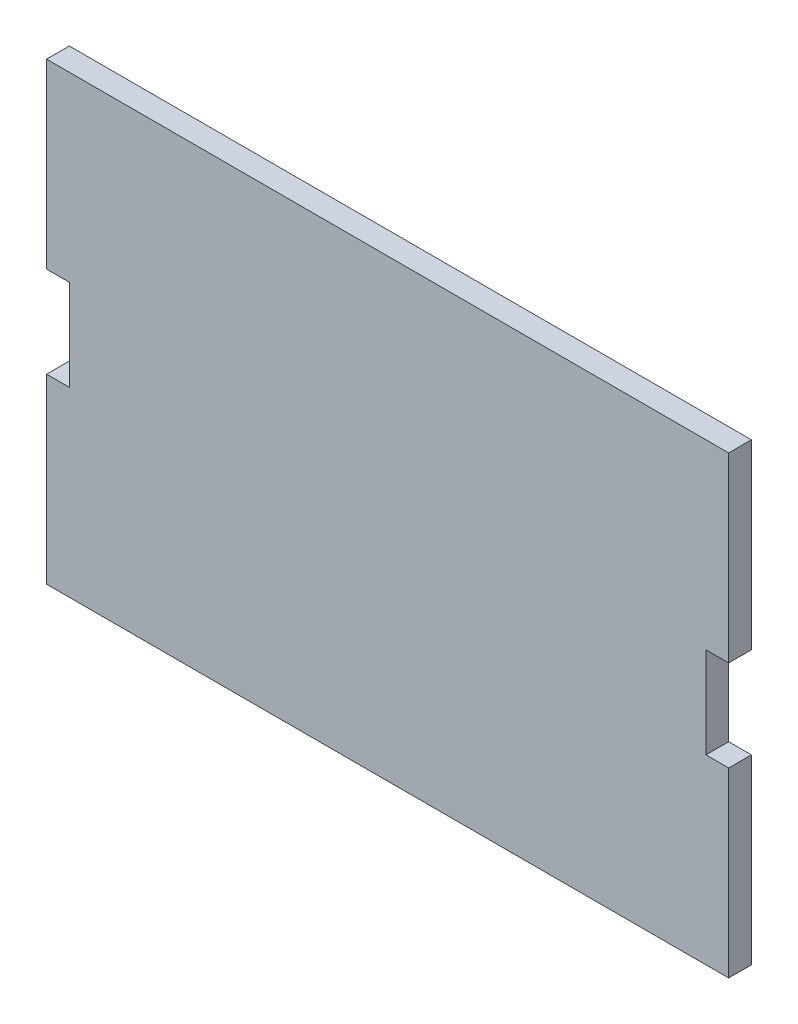
ISO-10303-21;
HEADER;
FILE_DESCRIPTION(('STEP AP214'),'2;1');
FILE_NAME('part.step','',(''),(''),'','','');
FILE_SCHEMA(('AUTOMOTIVE_DESIGN { 1 0 10303 214 1 1 1 1 }'));
ENDSEC;
DATA;
#1=APPLICATION_CONTEXT('core data for automotive mechanical design processes');
#2=APPLICATION_PROTOCOL_DEFINITION('international standard','automotive_design',2000,#1);
#3=PRODUCT_CONTEXT('',#1,'mechanical');
#4=PRODUCT('Part','Part','',(#3));
#5=PRODUCT_RELATED_PRODUCT_CATEGORY('part','',(#4));
#6=PRODUCT_DEFINITION_FORMATION('','',#4);
#7=PRODUCT_DEFINITION_CONTEXT('part definition',#1,'design');
#8=PRODUCT_DEFINITION('design','',#6,#7);
#9=PRODUCT_DEFINITION_SHAPE('','',#8);
#10=(LENGTH_UNIT() NAMED_UNIT(*) SI_UNIT(.MILLI.,.METRE.));
#11=(NAMED_UNIT(*) PLANE_ANGLE_UNIT() SI_UNIT($,.RADIAN.));
#12=(NAMED_UNIT(*) SI_UNIT($,.STERADIAN.) SOLID_ANGLE_UNIT());
#13=UNCERTAINTY_MEASURE_WITH_UNIT(LENGTH_MEASURE(1.E-05),#10,'distance_accuracy_value','');
#14=(GEOMETRIC_REPRESENTATION_CONTEXT(3) GLOBAL_UNCERTAINTY_ASSIGNED_CONTEXT((#13)) GLOBAL_UNIT_ASSIGNED_CONTEXT((#10,
#11,#12)) REPRESENTATION_CONTEXT('',''));
#15=CARTESIAN_POINT('',(0.,0.,0.));
#16=DIRECTION('',(0.,0.,1.));
#17=DIRECTION('',(1.,0.,0.));
#18=AXIS2_PLACEMENT_3D('',#15,#16,#17);
#19=CARTESIAN_POINT('',(750.,2.77555756156289E-13,50.));
#20=DIRECTION('',(-1.,0.,0.));
#21=DIRECTION('',(0.,-1.,0.));
#22=AXIS2_PLACEMENT_3D('',#19,#20,#21);
#23=PLANE('',#22);
#24=DIRECTION('',(0.,1.,0.));
#25=VECTOR('',#24,1.);
#26=CARTESIAN_POINT('',(750.,2.77555756156289E-13,0.));
#27=LINE('',#26,#25);
#28=CARTESIAN_POINT('',(750.,-1000.,0.));
#29=VERTEX_POINT('',#28);
#30=CARTESIAN_POINT('',(750.000000000001,-600.,0.));
#31=VERTEX_POINT('',#30);
#32=EDGE_CURVE('E148',#29,#31,#27,.T.);
#33=ORIENTED_EDGE('',*,*,#32,.T.);
#34=DIRECTION('',(0.,0.,1.));
#35=VECTOR('',#34,1.);
#36=CARTESIAN_POINT('',(750.000000000001,-600.,-0.001000000000001));
#37=LINE('',#36,#35);
#38=CARTESIAN_POINT('',(750.000000000001,-600.,50.));
#39=VERTEX_POINT('',#38);
#40=EDGE_CURVE('E133',#31,#39,#37,.T.);
#41=ORIENTED_EDGE('',*,*,#40,.T.);
#42=DIRECTION('',(0.,1.,0.));
#43=VECTOR('',#42,1.);
#44=CARTESIAN_POINT('',(750.,2.77555756156289E-13,50.));
#45=LINE('',#44,#43);
#46=CARTESIAN_POINT('',(750.,-1000.,50.));
#47=VERTEX_POINT('',#46);
#48=EDGE_CURVE('E170',#47,#39,#45,.T.);
#49=ORIENTED_EDGE('',*,*,#48,.F.);
#50=DIRECTION('',(0.,0.,-1.));
#51=VECTOR('',#50,1.);
#52=CARTESIAN_POINT('',(750.,-1000.,50.));
#53=LINE('',#52,#51);
#54=EDGE_CURVE('E44',#47,#29,#53,.T.);
#55=ORIENTED_EDGE('',*,*,#54,.T.);
#56=EDGE_LOOP('',(#33,#41,#49,#55));
#57=FACE_BOUND('',#56,.T.);
#58=ADVANCED_FACE('F36',(#57),#23,.F.);
#59=CARTESIAN_POINT('',(-750.,0.,50.));
#60=DIRECTION('',(1.,0.,0.));
#61=DIRECTION('',(0.,0.,-1.));
#62=AXIS2_PLACEMENT_3D('',#59,#60,#61);
#63=PLANE('',#62);
#64=DIRECTION('',(0.,-1.,0.));
#65=VECTOR('',#64,1.);
#66=CARTESIAN_POINT('',(-750.,0.,0.));
#67=LINE('',#66,#65);
#68=CARTESIAN_POINT('',(-750.,0.,0.));
#69=VERTEX_POINT('',#68);
#70=CARTESIAN_POINT('',(-750.,-400.,0.));
#71=VERTEX_POINT('',#70);
#72=EDGE_CURVE('E152',#69,#71,#67,.T.);
#73=ORIENTED_EDGE('',*,*,#72,.T.);
#74=DIRECTION('',(0.,0.,1.));
#75=VECTOR('',#74,1.);
#76=CARTESIAN_POINT('',(-750.,-400.,-0.001000000000001));
#77=LINE('',#76,#75);
#78=CARTESIAN_POINT('',(-750.,-400.,50.));
#79=VERTEX_POINT('',#78);
#80=EDGE_CURVE('E205',#71,#79,#77,.T.);
#81=ORIENTED_EDGE('',*,*,#80,.T.);
#82=DIRECTION('',(0.,-1.,0.));
#83=VECTOR('',#82,1.);
#84=CARTESIAN_POINT('',(-750.,0.,50.));
#85=LINE('',#84,#83);
#86=CARTESIAN_POINT('',(-750.,0.,50.));
#87=VERTEX_POINT('',#86);
#88=EDGE_CURVE('E216',#87,#79,#85,.T.);
#89=ORIENTED_EDGE('',*,*,#88,.F.);
#90=DIRECTION('',(0.,0.,-1.));
#91=VECTOR('',#90,1.);
#92=CARTESIAN_POINT('',(-750.,0.,50.));
#93=LINE('',#92,#91);
#94=EDGE_CURVE('E158',#87,#69,#93,.T.);
#95=ORIENTED_EDGE('',*,*,#94,.T.);
#96=EDGE_LOOP('',(#73,#81,#89,#95));
#97=FACE_BOUND('',#96,.T.);
#98=ADVANCED_FACE('F242',(#97),#63,.F.);
#99=CARTESIAN_POINT('',(-750.,-600.,50.));
#100=VERTEX_POINT('',#99);
#101=CARTESIAN_POINT('',(-750.,-1000.,50.));
#102=VERTEX_POINT('',#101);
#103=EDGE_CURVE('E157',#100,#102,#85,.T.);
#104=ORIENTED_EDGE('',*,*,#103,.F.);
#105=DIRECTION('',(0.,0.,1.));
#106=VECTOR('',#105,1.);
#107=CARTESIAN_POINT('',(-750.,-600.,-0.001000000000001));
#108=LINE('',#107,#106);
#109=CARTESIAN_POINT('',(-750.,-600.,0.));
#110=VERTEX_POINT('',#109);
#111=EDGE_CURVE('E204',#110,#100,#108,.T.);
#112=ORIENTED_EDGE('',*,*,#111,.F.);
#113=CARTESIAN_POINT('',(-750.,-1000.,0.));
#114=VERTEX_POINT('',#113);
#115=EDGE_CURVE('E215',#110,#114,#67,.T.);
#116=ORIENTED_EDGE('',*,*,#115,.T.);
#117=DIRECTION('',(0.,0.,-1.));
#118=VECTOR('',#117,1.);
#119=CARTESIAN_POINT('',(-750.,-1000.,50.));
#120=LINE('',#119,#118);
#121=EDGE_CURVE('E11',#102,#114,#120,.T.);
#122=ORIENTED_EDGE('',*,*,#121,.F.);
#123=EDGE_LOOP('',(#104,#112,#116,#122));
#124=FACE_BOUND('',#123,.T.);
#125=ADVANCED_FACE('F38',(#124),#63,.F.);
#126=CARTESIAN_POINT('',(-750.,-1000.,50.));
#127=DIRECTION('',(0.,1.,0.));
#128=DIRECTION('',(-1.,0.,0.));
#129=AXIS2_PLACEMENT_3D('',#126,#127,#128);
#130=PLANE('',#129);
#131=DIRECTION('',(1.,0.,0.));
#132=VECTOR('',#131,1.);
#133=CARTESIAN_POINT('',(-750.,-1000.,0.));
#134=LINE('',#133,#132);
#135=EDGE_CURVE('E149',#114,#29,#134,.T.);
#136=ORIENTED_EDGE('',*,*,#135,.T.);
#137=ORIENTED_EDGE('',*,*,#54,.F.);
#138=DIRECTION('',(1.,0.,0.));
#139=VECTOR('',#138,1.);
#140=CARTESIAN_POINT('',(-750.,-1000.,50.));
#141=LINE('',#140,#139);
#142=EDGE_CURVE('E219',#102,#47,#141,.T.);
#143=ORIENTED_EDGE('',*,*,#142,.F.);
#144=ORIENTED_EDGE('',*,*,#121,.T.);
#145=EDGE_LOOP('',(#136,#137,#143,#144));
#146=FACE_BOUND('',#145,.T.);
#147=ADVANCED_FACE('F250',(#146),#130,.F.);
#148=CARTESIAN_POINT('',(750.000000000001,-400.,50.));
#149=VERTEX_POINT('',#148);
#150=CARTESIAN_POINT('',(750.,2.77555756156289E-13,50.));
#151=VERTEX_POINT('',#150);
#152=EDGE_CURVE('E141',#149,#151,#45,.T.);
#153=ORIENTED_EDGE('',*,*,#152,.F.);
#154=DIRECTION('',(0.,0.,1.));
#155=VECTOR('',#154,1.);
#156=CARTESIAN_POINT('',(750.000000000001,-400.,-0.001000000000001));
#157=LINE('',#156,#155);
#158=CARTESIAN_POINT('',(750.,-400.,0.));
#159=VERTEX_POINT('',#158);
#160=EDGE_CURVE('E128',#159,#149,#157,.T.);
#161=ORIENTED_EDGE('',*,*,#160,.F.);
#162=CARTESIAN_POINT('',(750.,2.77555756156289E-13,0.));
#163=VERTEX_POINT('',#162);
#164=EDGE_CURVE('E139',#159,#163,#27,.T.);
#165=ORIENTED_EDGE('',*,*,#164,.T.);
#166=DIRECTION('',(0.,0.,-1.));
#167=VECTOR('',#166,1.);
#168=CARTESIAN_POINT('',(750.,2.77555756156289E-13,50.));
#169=LINE('',#168,#167);
#170=EDGE_CURVE('E161',#151,#163,#169,.T.);
#171=ORIENTED_EDGE('',*,*,#170,.F.);
#172=EDGE_LOOP('',(#153,#161,#165,#171));
#173=FACE_BOUND('',#172,.T.);
#174=ADVANCED_FACE('F137',(#173),#23,.F.);
#175=CARTESIAN_POINT('',(-750.,0.,50.));
#176=DIRECTION('',(0.,-1.,0.));
#177=DIRECTION('',(1.,0.,0.));
#178=AXIS2_PLACEMENT_3D('',#175,#176,#177);
#179=PLANE('',#178);
#180=DIRECTION('',(-1.,0.,0.));
#181=VECTOR('',#180,1.);
#182=CARTESIAN_POINT('',(-750.,0.,0.));
#183=LINE('',#182,#181);
#184=EDGE_CURVE('E147',#163,#69,#183,.T.);
#185=ORIENTED_EDGE('',*,*,#184,.T.);
#186=ORIENTED_EDGE('',*,*,#94,.F.);
#187=DIRECTION('',(-1.,0.,0.));
#188=VECTOR('',#187,1.);
#189=CARTESIAN_POINT('',(-750.,0.,50.));
#190=LINE('',#189,#188);
#191=EDGE_CURVE('E162',#151,#87,#190,.T.);
#192=ORIENTED_EDGE('',*,*,#191,.F.);
#193=ORIENTED_EDGE('',*,*,#170,.T.);
#194=EDGE_LOOP('',(#185,#186,#192,#193));
#195=FACE_BOUND('',#194,.T.);
#196=ADVANCED_FACE('F246',(#195),#179,.F.);
#197=CARTESIAN_POINT('',(0.,0.,50.));
#198=DIRECTION('',(0.,0.,1.));
#199=DIRECTION('',(1.,0.,0.));
#200=AXIS2_PLACEMENT_3D('',#197,#198,#199);
#201=PLANE('',#200);
#202=DIRECTION('',(1.,0.,0.));
#203=VECTOR('',#202,1.);
#204=CARTESIAN_POINT('',(750.000000000001,-600.,50.));
#205=LINE('',#204,#203);
#206=CARTESIAN_POINT('',(700.000000000001,-600.,50.));
#207=VERTEX_POINT('',#206);
#208=EDGE_CURVE('E142',#207,#39,#205,.T.);
#209=ORIENTED_EDGE('',*,*,#208,.F.);
#210=DIRECTION('',(0.,-1.,0.));
#211=VECTOR('',#210,1.);
#212=CARTESIAN_POINT('',(700.000000000001,-400.,50.));
#213=LINE('',#212,#211);
#214=CARTESIAN_POINT('',(700.000000000001,-400.,50.));
#215=VERTEX_POINT('',#214);
#216=EDGE_CURVE('E181',#215,#207,#213,.T.);
#217=ORIENTED_EDGE('',*,*,#216,.F.);
#218=DIRECTION('',(-1.,0.,0.));
#219=VECTOR('',#218,1.);
#220=CARTESIAN_POINT('',(750.000000000001,-400.,50.));
#221=LINE('',#220,#219);
#222=EDGE_CURVE('E179',#149,#215,#221,.T.);
#223=ORIENTED_EDGE('',*,*,#222,.F.);
#224=ORIENTED_EDGE('',*,*,#152,.T.);
#225=ORIENTED_EDGE('',*,*,#191,.T.);
#226=ORIENTED_EDGE('',*,*,#88,.T.);
#227=DIRECTION('',(-1.,0.,0.));
#228=VECTOR('',#227,1.);
#229=CARTESIAN_POINT('',(-750.,-400.,50.));
#230=LINE('',#229,#228);
#231=CARTESIAN_POINT('',(-700.,-400.,50.));
#232=VERTEX_POINT('',#231);
#233=EDGE_CURVE('E202',#232,#79,#230,.T.);
#234=ORIENTED_EDGE('',*,*,#233,.F.);
#235=DIRECTION('',(0.,1.,0.));
#236=VECTOR('',#235,1.);
#237=CARTESIAN_POINT('',(-700.,-400.,50.));
#238=LINE('',#237,#236);
#239=CARTESIAN_POINT('',(-700.,-600.,50.));
#240=VERTEX_POINT('',#239);
#241=EDGE_CURVE('E199',#240,#232,#238,.T.);
#242=ORIENTED_EDGE('',*,*,#241,.F.);
#243=DIRECTION('',(1.,0.,0.));
#244=VECTOR('',#243,1.);
#245=CARTESIAN_POINT('',(-750.,-600.,50.));
#246=LINE('',#245,#244);
#247=EDGE_CURVE('E196',#100,#240,#246,.T.);
#248=ORIENTED_EDGE('',*,*,#247,.F.);
#249=ORIENTED_EDGE('',*,*,#103,.T.);
#250=ORIENTED_EDGE('',*,*,#142,.T.);
#251=ORIENTED_EDGE('',*,*,#48,.T.);
#252=EDGE_LOOP('',(#209,#217,#223,#224,#225,#226,#234,#242,#248,#249,#250,#251));
#253=FACE_BOUND('',#252,.T.);
#254=ADVANCED_FACE('F238',(#253),#201,.T.);
#255=CARTESIAN_POINT('',(0.,0.,0.));
#256=DIRECTION('',(0.,0.,1.));
#257=DIRECTION('',(1.,0.,0.));
#258=AXIS2_PLACEMENT_3D('',#255,#256,#257);
#259=PLANE('',#258);
#260=DIRECTION('',(0.,1.,0.));
#261=VECTOR('',#260,1.);
#262=CARTESIAN_POINT('',(700.000000000001,-400.,0.));
#263=LINE('',#262,#261);
#264=CARTESIAN_POINT('',(700.000000000001,-600.,0.));
#265=VERTEX_POINT('',#264);
#266=CARTESIAN_POINT('',(700.000000000001,-400.,0.));
#267=VERTEX_POINT('',#266);
#268=EDGE_CURVE('E51',#265,#267,#263,.T.);
#269=ORIENTED_EDGE('',*,*,#268,.F.);
#270=DIRECTION('',(-1.,0.,0.));
#271=VECTOR('',#270,1.);
#272=CARTESIAN_POINT('',(750.000000000001,-600.,0.));
#273=LINE('',#272,#271);
#274=EDGE_CURVE('E177',#31,#265,#273,.T.);
#275=ORIENTED_EDGE('',*,*,#274,.F.);
#276=ORIENTED_EDGE('',*,*,#32,.F.);
#277=ORIENTED_EDGE('',*,*,#135,.F.);
#278=ORIENTED_EDGE('',*,*,#115,.F.);
#279=DIRECTION('',(-1.,0.,0.));
#280=VECTOR('',#279,1.);
#281=CARTESIAN_POINT('',(-750.,-600.,0.));
#282=LINE('',#281,#280);
#283=CARTESIAN_POINT('',(-700.,-600.,0.));
#284=VERTEX_POINT('',#283);
#285=EDGE_CURVE('E208',#284,#110,#282,.T.);
#286=ORIENTED_EDGE('',*,*,#285,.F.);
#287=DIRECTION('',(0.,-1.,0.));
#288=VECTOR('',#287,1.);
#289=CARTESIAN_POINT('',(-700.,-400.,0.));
#290=LINE('',#289,#288);
#291=CARTESIAN_POINT('',(-700.,-400.,0.));
#292=VERTEX_POINT('',#291);
#293=EDGE_CURVE('E59',#292,#284,#290,.T.);
#294=ORIENTED_EDGE('',*,*,#293,.F.);
#295=DIRECTION('',(1.,0.,0.));
#296=VECTOR('',#295,1.);
#297=CARTESIAN_POINT('',(-750.,-400.,0.));
#298=LINE('',#297,#296);
#299=EDGE_CURVE('E193',#71,#292,#298,.T.);
#300=ORIENTED_EDGE('',*,*,#299,.F.);
#301=ORIENTED_EDGE('',*,*,#72,.F.);
#302=ORIENTED_EDGE('',*,*,#184,.F.);
#303=ORIENTED_EDGE('',*,*,#164,.F.);
#304=DIRECTION('',(1.,0.,0.));
#305=VECTOR('',#304,1.);
#306=CARTESIAN_POINT('',(750.000000000001,-400.,0.));
#307=LINE('',#306,#305);
#308=EDGE_CURVE('E124',#267,#159,#307,.T.);
#309=ORIENTED_EDGE('',*,*,#308,.F.);
#310=EDGE_LOOP('',(#269,#275,#276,#277,#278,#286,#294,#300,#301,#302,#303,#309));
#311=FACE_BOUND('',#310,.T.);
#312=ADVANCED_FACE('F145',(#311),#259,.F.);
#313=CARTESIAN_POINT('',(-750.,-400.,-0.001000000000001));
#314=DIRECTION('',(0.,1.,0.));
#315=DIRECTION('',(0.,0.,1.));
#316=AXIS2_PLACEMENT_3D('',#313,#314,#315);
#317=PLANE('',#316);
#318=ORIENTED_EDGE('',*,*,#299,.T.);
#319=DIRECTION('',(0.,0.,1.));
#320=VECTOR('',#319,1.);
#321=CARTESIAN_POINT('',(-700.,-400.,-0.001000000000001));
#322=LINE('',#321,#320);
#323=EDGE_CURVE('E209',#292,#232,#322,.T.);
#324=ORIENTED_EDGE('',*,*,#323,.T.);
#325=ORIENTED_EDGE('',*,*,#233,.T.);
#326=ORIENTED_EDGE('',*,*,#80,.F.);
#327=EDGE_LOOP('',(#318,#324,#325,#326));
#328=FACE_BOUND('',#327,.T.);
#329=ADVANCED_FACE('F241',(#328),#317,.F.);
#330=CARTESIAN_POINT('',(-700.,-400.,-0.001000000000001));
#331=DIRECTION('',(1.,0.,0.));
#332=DIRECTION('',(0.,0.,-1.));
#333=AXIS2_PLACEMENT_3D('',#330,#331,#332);
#334=PLANE('',#333);
#335=ORIENTED_EDGE('',*,*,#293,.T.);
#336=DIRECTION('',(0.,0.,1.));
#337=VECTOR('',#336,1.);
#338=CARTESIAN_POINT('',(-700.,-600.,-0.001000000000001));
#339=LINE('',#338,#337);
#340=EDGE_CURVE('E211',#284,#240,#339,.T.);
#341=ORIENTED_EDGE('',*,*,#340,.T.);
#342=ORIENTED_EDGE('',*,*,#241,.T.);
#343=ORIENTED_EDGE('',*,*,#323,.F.);
#344=EDGE_LOOP('',(#335,#341,#342,#343));
#345=FACE_BOUND('',#344,.T.);
#346=ADVANCED_FACE('F234',(#345),#334,.F.);
#347=CARTESIAN_POINT('',(-750.,-600.,-0.001000000000001));
#348=DIRECTION('',(0.,-1.,0.));
#349=DIRECTION('',(0.,0.,-1.));
#350=AXIS2_PLACEMENT_3D('',#347,#348,#349);
#351=PLANE('',#350);
#352=ORIENTED_EDGE('',*,*,#285,.T.);
#353=ORIENTED_EDGE('',*,*,#111,.T.);
#354=ORIENTED_EDGE('',*,*,#247,.T.);
#355=ORIENTED_EDGE('',*,*,#340,.F.);
#356=EDGE_LOOP('',(#352,#353,#354,#355));
#357=FACE_BOUND('',#356,.T.);
#358=ADVANCED_FACE('F231',(#357),#351,.F.);
#359=CARTESIAN_POINT('',(750.000000000001,-600.,-0.001000000000001));
#360=DIRECTION('',(0.,-1.,0.));
#361=DIRECTION('',(0.,0.,-1.));
#362=AXIS2_PLACEMENT_3D('',#359,#360,#361);
#363=PLANE('',#362);
#364=ORIENTED_EDGE('',*,*,#274,.T.);
#365=DIRECTION('',(0.,0.,1.));
#366=VECTOR('',#365,1.);
#367=CARTESIAN_POINT('',(700.000000000001,-600.,-0.001000000000001));
#368=LINE('',#367,#366);
#369=EDGE_CURVE('E189',#265,#207,#368,.T.);
#370=ORIENTED_EDGE('',*,*,#369,.T.);
#371=ORIENTED_EDGE('',*,*,#208,.T.);
#372=ORIENTED_EDGE('',*,*,#40,.F.);
#373=EDGE_LOOP('',(#364,#370,#371,#372));
#374=FACE_BOUND('',#373,.T.);
#375=ADVANCED_FACE('F249',(#374),#363,.F.);
#376=CARTESIAN_POINT('',(700.000000000001,-400.,-0.001000000000001));
#377=DIRECTION('',(-1.,0.,0.));
#378=DIRECTION('',(0.,0.,1.));
#379=AXIS2_PLACEMENT_3D('',#376,#377,#378);
#380=PLANE('',#379);
#381=ORIENTED_EDGE('',*,*,#268,.T.);
#382=DIRECTION('',(0.,0.,1.));
#383=VECTOR('',#382,1.);
#384=CARTESIAN_POINT('',(700.000000000001,-400.,-0.001000000000001));
#385=LINE('',#384,#383);
#386=EDGE_CURVE('E130',#267,#215,#385,.T.);
#387=ORIENTED_EDGE('',*,*,#386,.T.);
#388=ORIENTED_EDGE('',*,*,#216,.T.);
#389=ORIENTED_EDGE('',*,*,#369,.F.);
#390=EDGE_LOOP('',(#381,#387,#388,#389));
#391=FACE_BOUND('',#390,.T.);
#392=ADVANCED_FACE('F248',(#391),#380,.F.);
#393=CARTESIAN_POINT('',(750.000000000001,-400.,-0.001000000000001));
#394=DIRECTION('',(0.,1.,0.));
#395=DIRECTION('',(-1.,0.,0.));
#396=AXIS2_PLACEMENT_3D('',#393,#394,#395);
#397=PLANE('',#396);
#398=ORIENTED_EDGE('',*,*,#308,.T.);
#399=ORIENTED_EDGE('',*,*,#160,.T.);
#400=ORIENTED_EDGE('',*,*,#222,.T.);
#401=ORIENTED_EDGE('',*,*,#386,.F.);
#402=EDGE_LOOP('',(#398,#399,#400,#401));
#403=FACE_BOUND('',#402,.T.);
#404=ADVANCED_FACE('F126',(#403),#397,.F.);
#405=CLOSED_SHELL('',(#58,#98,#125,#147,#174,#196,#254,#312,#329,#346,#358,#375,#392,#404));
#406=MANIFOLD_SOLID_BREP('B2',#405);
#407=ADVANCED_BREP_SHAPE_REPRESENTATION('',(#18,#406),#14);
#408=SHAPE_DEFINITION_REPRESENTATION(#9,#407);
ENDSEC;
END-ISO-10303-21;
